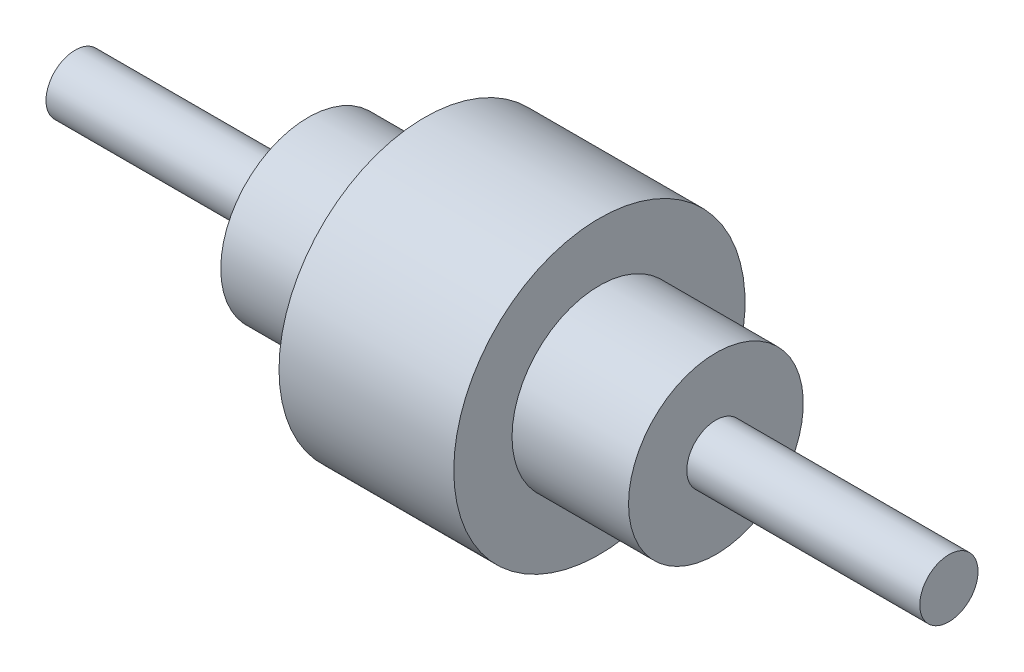
ISO-10303-21;
HEADER;
FILE_DESCRIPTION(('STEP AP214'),'2;1');
FILE_NAME('part.step','',(''),(''),'','','');
FILE_SCHEMA(('AUTOMOTIVE_DESIGN { 1 0 10303 214 1 1 1 1 }'));
ENDSEC;
DATA;
#1=APPLICATION_CONTEXT('core data for automotive mechanical design processes');
#2=APPLICATION_PROTOCOL_DEFINITION('international standard','automotive_design',2000,#1);
#3=PRODUCT_CONTEXT('',#1,'mechanical');
#4=PRODUCT('Part','Part','',(#3));
#5=PRODUCT_RELATED_PRODUCT_CATEGORY('part','',(#4));
#6=PRODUCT_DEFINITION_FORMATION('','',#4);
#7=PRODUCT_DEFINITION_CONTEXT('part definition',#1,'design');
#8=PRODUCT_DEFINITION('design','',#6,#7);
#9=PRODUCT_DEFINITION_SHAPE('','',#8);
#10=(LENGTH_UNIT() NAMED_UNIT(*) SI_UNIT(.MILLI.,.METRE.));
#11=(NAMED_UNIT(*) PLANE_ANGLE_UNIT() SI_UNIT($,.RADIAN.));
#12=(NAMED_UNIT(*) SI_UNIT($,.STERADIAN.) SOLID_ANGLE_UNIT());
#13=UNCERTAINTY_MEASURE_WITH_UNIT(LENGTH_MEASURE(1.E-05),#10,'distance_accuracy_value','');
#14=(GEOMETRIC_REPRESENTATION_CONTEXT(3) GLOBAL_UNCERTAINTY_ASSIGNED_CONTEXT((#13)) GLOBAL_UNIT_ASSIGNED_CONTEXT((#10,
#11,#12)) REPRESENTATION_CONTEXT('',''));
#15=CARTESIAN_POINT('',(0.,0.,0.));
#16=DIRECTION('',(0.,0.,1.));
#17=DIRECTION('',(1.,0.,0.));
#18=AXIS2_PLACEMENT_3D('',#15,#16,#17);
#19=CARTESIAN_POINT('',(0.,0.,0.));
#20=DIRECTION('',(1.,0.,0.));
#21=DIRECTION('',(0.,0.,-1.));
#22=AXIS2_PLACEMENT_3D('',#19,#20,#21);
#23=PLANE('',#22);
#24=CARTESIAN_POINT('',(0.,0.,0.));
#25=DIRECTION('',(-1.,0.,0.));
#26=DIRECTION('',(0.,0.,1.));
#27=AXIS2_PLACEMENT_3D('',#24,#25,#26);
#28=CIRCLE('',#27,10.);
#29=CARTESIAN_POINT('',(0.,0.,10.));
#30=VERTEX_POINT('',#29);
#31=EDGE_CURVE('E10',#30,#30,#28,.T.);
#32=ORIENTED_EDGE('',*,*,#31,.T.);
#33=EDGE_LOOP('',(#32));
#34=FACE_BOUND('',#33,.T.);
#35=ADVANCED_FACE('F30',(#34),#23,.F.);
#36=CARTESIAN_POINT('',(0.,0.,0.));
#37=DIRECTION('',(-1.,0.,0.));
#38=DIRECTION('',(0.,0.,1.));
#39=AXIS2_PLACEMENT_3D('',#36,#37,#38);
#40=CYLINDRICAL_SURFACE('',#39,10.);
#41=ORIENTED_EDGE('',*,*,#31,.F.);
#42=EDGE_LOOP('',(#41));
#43=FACE_BOUND('',#42,.T.);
#44=CARTESIAN_POINT('',(80.,0.,0.));
#45=DIRECTION('',(-1.,0.,0.));
#46=DIRECTION('',(0.,0.,1.));
#47=AXIS2_PLACEMENT_3D('',#44,#45,#46);
#48=CIRCLE('',#47,10.);
#49=CARTESIAN_POINT('',(80.,0.,10.));
#50=VERTEX_POINT('',#49);
#51=EDGE_CURVE('E36',#50,#50,#48,.T.);
#52=ORIENTED_EDGE('',*,*,#51,.T.);
#53=EDGE_LOOP('',(#52));
#54=FACE_BOUND('',#53,.T.);
#55=ADVANCED_FACE('F80',(#43,#54),#40,.T.);
#56=CARTESIAN_POINT('',(80.,0.,-10.));
#57=DIRECTION('',(1.,0.,0.));
#58=DIRECTION('',(0.,0.,-1.));
#59=AXIS2_PLACEMENT_3D('',#56,#57,#58);
#60=PLANE('',#59);
#61=ORIENTED_EDGE('',*,*,#51,.F.);
#62=EDGE_LOOP('',(#61));
#63=FACE_BOUND('',#62,.T.);
#64=CARTESIAN_POINT('',(80.,0.,0.));
#65=DIRECTION('',(-1.,0.,0.));
#66=DIRECTION('',(0.,0.,1.));
#67=AXIS2_PLACEMENT_3D('',#64,#65,#66);
#68=CIRCLE('',#67,30.);
#69=CARTESIAN_POINT('',(80.,0.,30.));
#70=VERTEX_POINT('',#69);
#71=EDGE_CURVE('E40',#70,#70,#68,.T.);
#72=ORIENTED_EDGE('',*,*,#71,.T.);
#73=EDGE_LOOP('',(#72));
#74=FACE_BOUND('',#73,.T.);
#75=ADVANCED_FACE('F84',(#63,#74),#60,.F.);
#76=CARTESIAN_POINT('',(0.,0.,0.));
#77=DIRECTION('',(-1.,0.,0.));
#78=DIRECTION('',(0.,0.,1.));
#79=AXIS2_PLACEMENT_3D('',#76,#77,#78);
#80=CYLINDRICAL_SURFACE('',#79,30.);
#81=ORIENTED_EDGE('',*,*,#71,.F.);
#82=EDGE_LOOP('',(#81));
#83=FACE_BOUND('',#82,.T.);
#84=CARTESIAN_POINT('',(120.,0.,0.));
#85=DIRECTION('',(-1.,0.,0.));
#86=DIRECTION('',(0.,0.,1.));
#87=AXIS2_PLACEMENT_3D('',#84,#85,#86);
#88=CIRCLE('',#87,30.);
#89=CARTESIAN_POINT('',(120.,0.,30.));
#90=VERTEX_POINT('',#89);
#91=EDGE_CURVE('E44',#90,#90,#88,.T.);
#92=ORIENTED_EDGE('',*,*,#91,.T.);
#93=EDGE_LOOP('',(#92));
#94=FACE_BOUND('',#93,.T.);
#95=ADVANCED_FACE('F89',(#83,#94),#80,.T.);
#96=CARTESIAN_POINT('',(120.,0.,-30.));
#97=DIRECTION('',(1.,0.,0.));
#98=DIRECTION('',(0.,0.,-1.));
#99=AXIS2_PLACEMENT_3D('',#96,#97,#98);
#100=PLANE('',#99);
#101=ORIENTED_EDGE('',*,*,#91,.F.);
#102=EDGE_LOOP('',(#101));
#103=FACE_BOUND('',#102,.T.);
#104=CARTESIAN_POINT('',(120.,0.,0.));
#105=DIRECTION('',(-1.,0.,0.));
#106=DIRECTION('',(0.,0.,1.));
#107=AXIS2_PLACEMENT_3D('',#104,#105,#106);
#108=CIRCLE('',#107,50.);
#109=CARTESIAN_POINT('',(120.,0.,50.));
#110=VERTEX_POINT('',#109);
#111=EDGE_CURVE('E49',#110,#110,#108,.T.);
#112=ORIENTED_EDGE('',*,*,#111,.T.);
#113=EDGE_LOOP('',(#112));
#114=FACE_BOUND('',#113,.T.);
#115=ADVANCED_FACE('F95',(#103,#114),#100,.F.);
#116=CARTESIAN_POINT('',(0.,0.,0.));
#117=DIRECTION('',(-1.,0.,0.));
#118=DIRECTION('',(0.,0.,1.));
#119=AXIS2_PLACEMENT_3D('',#116,#117,#118);
#120=CYLINDRICAL_SURFACE('',#119,50.);
#121=ORIENTED_EDGE('',*,*,#111,.F.);
#122=EDGE_LOOP('',(#121));
#123=FACE_BOUND('',#122,.T.);
#124=CARTESIAN_POINT('',(180.,0.,0.));
#125=DIRECTION('',(-1.,0.,0.));
#126=DIRECTION('',(0.,0.,1.));
#127=AXIS2_PLACEMENT_3D('',#124,#125,#126);
#128=CIRCLE('',#127,50.);
#129=CARTESIAN_POINT('',(180.,0.,50.));
#130=VERTEX_POINT('',#129);
#131=EDGE_CURVE('E52',#130,#130,#128,.T.);
#132=ORIENTED_EDGE('',*,*,#131,.T.);
#133=EDGE_LOOP('',(#132));
#134=FACE_BOUND('',#133,.T.);
#135=ADVANCED_FACE('F99',(#123,#134),#120,.T.);
#136=CARTESIAN_POINT('',(180.,0.,-50.));
#137=DIRECTION('',(-1.,0.,0.));
#138=DIRECTION('',(0.,0.,1.));
#139=AXIS2_PLACEMENT_3D('',#136,#137,#138);
#140=PLANE('',#139);
#141=ORIENTED_EDGE('',*,*,#131,.F.);
#142=EDGE_LOOP('',(#141));
#143=FACE_BOUND('',#142,.T.);
#144=CARTESIAN_POINT('',(180.,0.,0.));
#145=DIRECTION('',(-1.,0.,0.));
#146=DIRECTION('',(0.,0.,1.));
#147=AXIS2_PLACEMENT_3D('',#144,#145,#146);
#148=CIRCLE('',#147,30.);
#149=CARTESIAN_POINT('',(180.,0.,30.));
#150=VERTEX_POINT('',#149);
#151=EDGE_CURVE('E55',#150,#150,#148,.T.);
#152=ORIENTED_EDGE('',*,*,#151,.T.);
#153=EDGE_LOOP('',(#152));
#154=FACE_BOUND('',#153,.T.);
#155=ADVANCED_FACE('F103',(#143,#154),#140,.F.);
#156=CARTESIAN_POINT('',(0.,0.,0.));
#157=DIRECTION('',(-1.,0.,0.));
#158=DIRECTION('',(0.,0.,1.));
#159=AXIS2_PLACEMENT_3D('',#156,#157,#158);
#160=CYLINDRICAL_SURFACE('',#159,30.);
#161=ORIENTED_EDGE('',*,*,#151,.F.);
#162=EDGE_LOOP('',(#161));
#163=FACE_BOUND('',#162,.T.);
#164=CARTESIAN_POINT('',(220.,0.,0.));
#165=DIRECTION('',(-1.,0.,0.));
#166=DIRECTION('',(0.,0.,1.));
#167=AXIS2_PLACEMENT_3D('',#164,#165,#166);
#168=CIRCLE('',#167,30.);
#169=CARTESIAN_POINT('',(220.,0.,30.));
#170=VERTEX_POINT('',#169);
#171=EDGE_CURVE('E58',#170,#170,#168,.T.);
#172=ORIENTED_EDGE('',*,*,#171,.T.);
#173=EDGE_LOOP('',(#172));
#174=FACE_BOUND('',#173,.T.);
#175=ADVANCED_FACE('F107',(#163,#174),#160,.T.);
#176=CARTESIAN_POINT('',(220.,0.,-30.));
#177=DIRECTION('',(-1.,0.,0.));
#178=DIRECTION('',(0.,0.,1.));
#179=AXIS2_PLACEMENT_3D('',#176,#177,#178);
#180=PLANE('',#179);
#181=ORIENTED_EDGE('',*,*,#171,.F.);
#182=EDGE_LOOP('',(#181));
#183=FACE_BOUND('',#182,.T.);
#184=CARTESIAN_POINT('',(220.,0.,0.));
#185=DIRECTION('',(-1.,0.,0.));
#186=DIRECTION('',(0.,0.,1.));
#187=AXIS2_PLACEMENT_3D('',#184,#185,#186);
#188=CIRCLE('',#187,10.);
#189=CARTESIAN_POINT('',(220.,0.,10.));
#190=VERTEX_POINT('',#189);
#191=EDGE_CURVE('E61',#190,#190,#188,.T.);
#192=ORIENTED_EDGE('',*,*,#191,.T.);
#193=EDGE_LOOP('',(#192));
#194=FACE_BOUND('',#193,.T.);
#195=ADVANCED_FACE('F76',(#183,#194),#180,.F.);
#196=CARTESIAN_POINT('',(0.,0.,0.));
#197=DIRECTION('',(-1.,0.,0.));
#198=DIRECTION('',(0.,0.,1.));
#199=AXIS2_PLACEMENT_3D('',#196,#197,#198);
#200=CYLINDRICAL_SURFACE('',#199,10.);
#201=ORIENTED_EDGE('',*,*,#191,.F.);
#202=EDGE_LOOP('',(#201));
#203=FACE_BOUND('',#202,.T.);
#204=CARTESIAN_POINT('',(300.,0.,0.));
#205=DIRECTION('',(-1.,0.,0.));
#206=DIRECTION('',(0.,0.,1.));
#207=AXIS2_PLACEMENT_3D('',#204,#205,#206);
#208=CIRCLE('',#207,10.);
#209=CARTESIAN_POINT('',(300.,0.,10.));
#210=VERTEX_POINT('',#209);
#211=EDGE_CURVE('E64',#210,#210,#208,.T.);
#212=ORIENTED_EDGE('',*,*,#211,.T.);
#213=EDGE_LOOP('',(#212));
#214=FACE_BOUND('',#213,.T.);
#215=ADVANCED_FACE('F68',(#203,#214),#200,.T.);
#216=CARTESIAN_POINT('',(300.,0.,-10.));
#217=DIRECTION('',(-1.,0.,0.));
#218=DIRECTION('',(0.,0.,1.));
#219=AXIS2_PLACEMENT_3D('',#216,#217,#218);
#220=PLANE('',#219);
#221=ORIENTED_EDGE('',*,*,#211,.F.);
#222=EDGE_LOOP('',(#221));
#223=FACE_BOUND('',#222,.T.);
#224=ADVANCED_FACE('F70',(#223),#220,.F.);
#225=CLOSED_SHELL('',(#35,#55,#75,#95,#115,#135,#155,#175,#195,#215,#224));
#226=MANIFOLD_SOLID_BREP('B2',#225);
#227=ADVANCED_BREP_SHAPE_REPRESENTATION('',(#18,#226),#14);
#228=SHAPE_DEFINITION_REPRESENTATION(#9,#227);
ENDSEC;
END-ISO-10303-21;
